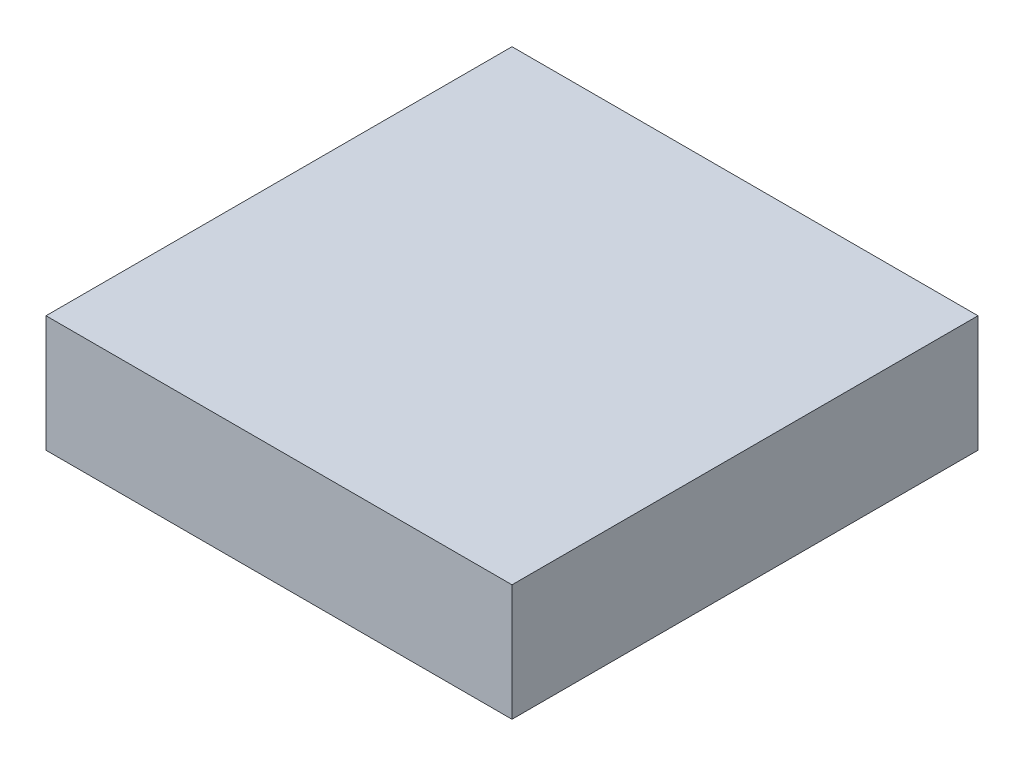
ISO-10303-21;
HEADER;
FILE_DESCRIPTION(('STEP AP214'),'2;1');
FILE_NAME('part.step','',(''),(''),'','','');
FILE_SCHEMA(('AUTOMOTIVE_DESIGN { 1 0 10303 214 1 1 1 1 }'));
ENDSEC;
DATA;
#1=APPLICATION_CONTEXT('core data for automotive mechanical design processes');
#2=APPLICATION_PROTOCOL_DEFINITION('international standard','automotive_design',2000,#1);
#3=PRODUCT_CONTEXT('',#1,'mechanical');
#4=PRODUCT('Part','Part','',(#3));
#5=PRODUCT_RELATED_PRODUCT_CATEGORY('part','',(#4));
#6=PRODUCT_DEFINITION_FORMATION('','',#4);
#7=PRODUCT_DEFINITION_CONTEXT('part definition',#1,'design');
#8=PRODUCT_DEFINITION('design','',#6,#7);
#9=PRODUCT_DEFINITION_SHAPE('','',#8);
#10=(LENGTH_UNIT() NAMED_UNIT(*) SI_UNIT(.MILLI.,.METRE.));
#11=(NAMED_UNIT(*) PLANE_ANGLE_UNIT() SI_UNIT($,.RADIAN.));
#12=(NAMED_UNIT(*) SI_UNIT($,.STERADIAN.) SOLID_ANGLE_UNIT());
#13=UNCERTAINTY_MEASURE_WITH_UNIT(LENGTH_MEASURE(1.E-05),#10,'distance_accuracy_value','');
#14=(GEOMETRIC_REPRESENTATION_CONTEXT(3) GLOBAL_UNCERTAINTY_ASSIGNED_CONTEXT((#13)) GLOBAL_UNIT_ASSIGNED_CONTEXT((#10,
#11,#12)) REPRESENTATION_CONTEXT('',''));
#15=CARTESIAN_POINT('',(0.,0.,0.));
#16=DIRECTION('',(0.,0.,1.));
#17=DIRECTION('',(1.,0.,0.));
#18=AXIS2_PLACEMENT_3D('',#15,#16,#17);
#19=CARTESIAN_POINT('',(-10.,5.,-10.));
#20=DIRECTION('',(1.,0.,0.));
#21=DIRECTION('',(0.,0.,-1.));
#22=AXIS2_PLACEMENT_3D('',#19,#20,#21);
#23=PLANE('',#22);
#24=DIRECTION('',(0.,0.,1.));
#25=VECTOR('',#24,1.);
#26=CARTESIAN_POINT('',(-10.,0.,-10.));
#27=LINE('',#26,#25);
#28=CARTESIAN_POINT('',(-10.,0.,-10.));
#29=VERTEX_POINT('',#28);
#30=CARTESIAN_POINT('',(-10.,0.,10.));
#31=VERTEX_POINT('',#30);
#32=EDGE_CURVE('E96',#29,#31,#27,.T.);
#33=ORIENTED_EDGE('',*,*,#32,.T.);
#34=DIRECTION('',(0.,-1.,0.));
#35=VECTOR('',#34,1.);
#36=CARTESIAN_POINT('',(-10.,5.,10.));
#37=LINE('',#36,#35);
#38=CARTESIAN_POINT('',(-10.,5.,10.));
#39=VERTEX_POINT('',#38);
#40=EDGE_CURVE('E11',#39,#31,#37,.T.);
#41=ORIENTED_EDGE('',*,*,#40,.F.);
#42=DIRECTION('',(0.,0.,1.));
#43=VECTOR('',#42,1.);
#44=CARTESIAN_POINT('',(-10.,5.,-10.));
#45=LINE('',#44,#43);
#46=CARTESIAN_POINT('',(-10.,5.,-10.));
#47=VERTEX_POINT('',#46);
#48=EDGE_CURVE('E84',#47,#39,#45,.T.);
#49=ORIENTED_EDGE('',*,*,#48,.F.);
#50=DIRECTION('',(0.,-1.,0.));
#51=VECTOR('',#50,1.);
#52=CARTESIAN_POINT('',(-10.,5.,-10.));
#53=LINE('',#52,#51);
#54=EDGE_CURVE('E92',#47,#29,#53,.T.);
#55=ORIENTED_EDGE('',*,*,#54,.T.);
#56=EDGE_LOOP('',(#33,#41,#49,#55));
#57=FACE_BOUND('',#56,.T.);
#58=ADVANCED_FACE('F33',(#57),#23,.F.);
#59=CARTESIAN_POINT('',(10.,5.,9.99999999999999));
#60=DIRECTION('',(0.,0.,-1.));
#61=DIRECTION('',(-1.,0.,0.));
#62=AXIS2_PLACEMENT_3D('',#59,#60,#61);
#63=PLANE('',#62);
#64=DIRECTION('',(1.,0.,0.));
#65=VECTOR('',#64,1.);
#66=CARTESIAN_POINT('',(10.,0.,9.99999999999999));
#67=LINE('',#66,#65);
#68=CARTESIAN_POINT('',(10.,0.,9.99999999999999));
#69=VERTEX_POINT('',#68);
#70=EDGE_CURVE('E88',#31,#69,#67,.T.);
#71=ORIENTED_EDGE('',*,*,#70,.T.);
#72=DIRECTION('',(0.,-1.,0.));
#73=VECTOR('',#72,1.);
#74=CARTESIAN_POINT('',(10.,5.,9.99999999999999));
#75=LINE('',#74,#73);
#76=CARTESIAN_POINT('',(10.,5.,9.99999999999999));
#77=VERTEX_POINT('',#76);
#78=EDGE_CURVE('E41',#77,#69,#75,.T.);
#79=ORIENTED_EDGE('',*,*,#78,.F.);
#80=DIRECTION('',(1.,0.,0.));
#81=VECTOR('',#80,1.);
#82=CARTESIAN_POINT('',(10.,5.,9.99999999999999));
#83=LINE('',#82,#81);
#84=EDGE_CURVE('E79',#39,#77,#83,.T.);
#85=ORIENTED_EDGE('',*,*,#84,.F.);
#86=ORIENTED_EDGE('',*,*,#40,.T.);
#87=EDGE_LOOP('',(#71,#79,#85,#86));
#88=FACE_BOUND('',#87,.T.);
#89=ADVANCED_FACE('F87',(#88),#63,.F.);
#90=CARTESIAN_POINT('',(9.99999999999999,5.,-10.));
#91=DIRECTION('',(-1.,0.,0.));
#92=DIRECTION('',(0.,0.,1.));
#93=AXIS2_PLACEMENT_3D('',#90,#91,#92);
#94=PLANE('',#93);
#95=DIRECTION('',(0.,0.,-1.));
#96=VECTOR('',#95,1.);
#97=CARTESIAN_POINT('',(9.99999999999999,0.,-10.));
#98=LINE('',#97,#96);
#99=CARTESIAN_POINT('',(9.99999999999999,0.,-10.));
#100=VERTEX_POINT('',#99);
#101=EDGE_CURVE('E66',#69,#100,#98,.T.);
#102=ORIENTED_EDGE('',*,*,#101,.T.);
#103=DIRECTION('',(0.,-1.,0.));
#104=VECTOR('',#103,1.);
#105=CARTESIAN_POINT('',(9.99999999999999,5.,-10.));
#106=LINE('',#105,#104);
#107=CARTESIAN_POINT('',(9.99999999999999,5.,-10.));
#108=VERTEX_POINT('',#107);
#109=EDGE_CURVE('E89',#108,#100,#106,.T.);
#110=ORIENTED_EDGE('',*,*,#109,.F.);
#111=DIRECTION('',(0.,0.,-1.));
#112=VECTOR('',#111,1.);
#113=CARTESIAN_POINT('',(9.99999999999999,5.,-10.));
#114=LINE('',#113,#112);
#115=EDGE_CURVE('E82',#77,#108,#114,.T.);
#116=ORIENTED_EDGE('',*,*,#115,.F.);
#117=ORIENTED_EDGE('',*,*,#78,.T.);
#118=EDGE_LOOP('',(#102,#110,#116,#117));
#119=FACE_BOUND('',#118,.T.);
#120=ADVANCED_FACE('F90',(#119),#94,.F.);
#121=CARTESIAN_POINT('',(9.99999999999999,5.,-10.));
#122=DIRECTION('',(0.,0.,1.));
#123=DIRECTION('',(1.,0.,0.));
#124=AXIS2_PLACEMENT_3D('',#121,#122,#123);
#125=PLANE('',#124);
#126=DIRECTION('',(-1.,0.,0.));
#127=VECTOR('',#126,1.);
#128=CARTESIAN_POINT('',(9.99999999999999,0.,-10.));
#129=LINE('',#128,#127);
#130=EDGE_CURVE('E72',#100,#29,#129,.T.);
#131=ORIENTED_EDGE('',*,*,#130,.T.);
#132=ORIENTED_EDGE('',*,*,#54,.F.);
#133=DIRECTION('',(-1.,0.,0.));
#134=VECTOR('',#133,1.);
#135=CARTESIAN_POINT('',(9.99999999999999,5.,-10.));
#136=LINE('',#135,#134);
#137=EDGE_CURVE('E49',#108,#47,#136,.T.);
#138=ORIENTED_EDGE('',*,*,#137,.F.);
#139=ORIENTED_EDGE('',*,*,#109,.T.);
#140=EDGE_LOOP('',(#131,#132,#138,#139));
#141=FACE_BOUND('',#140,.T.);
#142=ADVANCED_FACE('F103',(#141),#125,.F.);
#143=CARTESIAN_POINT('',(0.,5.,0.));
#144=DIRECTION('',(0.,-1.,0.));
#145=DIRECTION('',(0.,0.,-1.));
#146=AXIS2_PLACEMENT_3D('',#143,#144,#145);
#147=PLANE('',#146);
#148=ORIENTED_EDGE('',*,*,#48,.T.);
#149=ORIENTED_EDGE('',*,*,#84,.T.);
#150=ORIENTED_EDGE('',*,*,#115,.T.);
#151=ORIENTED_EDGE('',*,*,#137,.T.);
#152=EDGE_LOOP('',(#148,#149,#150,#151));
#153=FACE_BOUND('',#152,.T.);
#154=ADVANCED_FACE('F80',(#153),#147,.F.);
#155=CARTESIAN_POINT('',(0.,0.,0.));
#156=DIRECTION('',(0.,-1.,0.));
#157=DIRECTION('',(0.,0.,-1.));
#158=AXIS2_PLACEMENT_3D('',#155,#156,#157);
#159=PLANE('',#158);
#160=ORIENTED_EDGE('',*,*,#32,.F.);
#161=ORIENTED_EDGE('',*,*,#130,.F.);
#162=ORIENTED_EDGE('',*,*,#101,.F.);
#163=ORIENTED_EDGE('',*,*,#70,.F.);
#164=EDGE_LOOP('',(#160,#161,#162,#163));
#165=FACE_BOUND('',#164,.T.);
#166=ADVANCED_FACE('F106',(#165),#159,.T.);
#167=CLOSED_SHELL('',(#58,#89,#120,#142,#154,#166));
#168=MANIFOLD_SOLID_BREP('B2',#167);
#169=ADVANCED_BREP_SHAPE_REPRESENTATION('',(#18,#168),#14);
#170=SHAPE_DEFINITION_REPRESENTATION(#9,#169);
ENDSEC;
END-ISO-10303-21;
